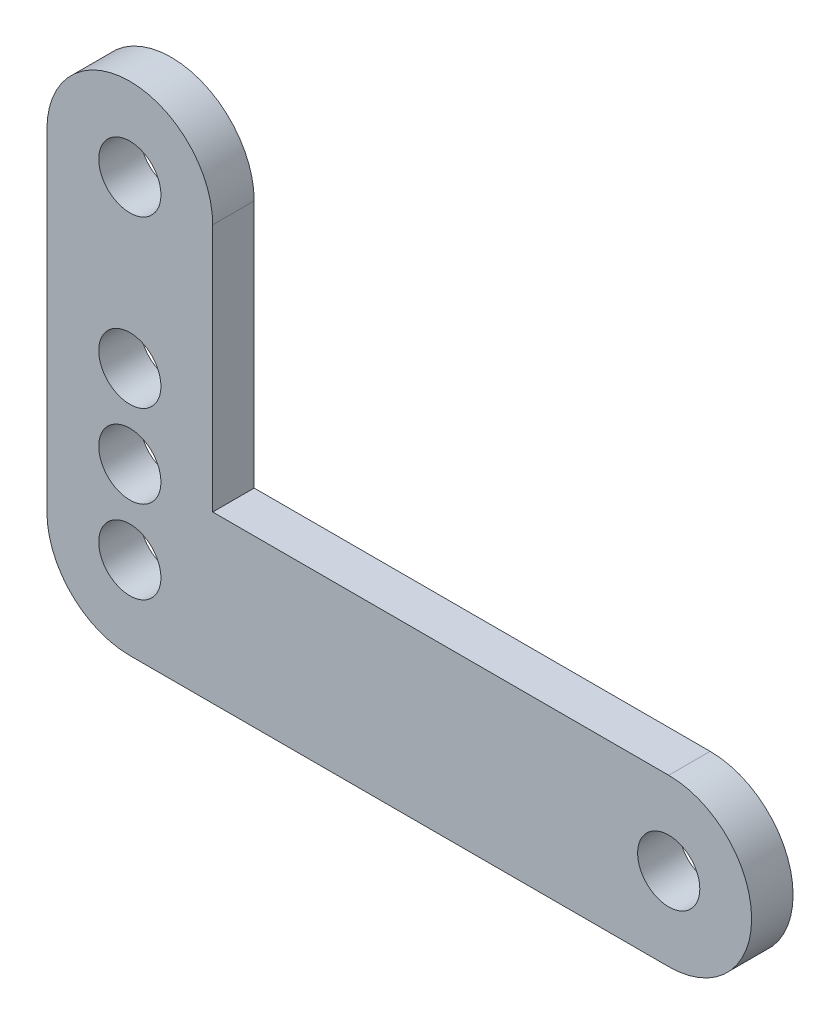
ISO-10303-21;
HEADER;
FILE_DESCRIPTION(('STEP AP214'),'2;1');
FILE_NAME('part.step','',(''),(''),'','','');
FILE_SCHEMA(('AUTOMOTIVE_DESIGN { 1 0 10303 214 1 1 1 1 }'));
ENDSEC;
DATA;
#1=APPLICATION_CONTEXT('core data for automotive mechanical design processes');
#2=APPLICATION_PROTOCOL_DEFINITION('international standard','automotive_design',2000,#1);
#3=PRODUCT_CONTEXT('',#1,'mechanical');
#4=PRODUCT('Part','Part','',(#3));
#5=PRODUCT_RELATED_PRODUCT_CATEGORY('part','',(#4));
#6=PRODUCT_DEFINITION_FORMATION('','',#4);
#7=PRODUCT_DEFINITION_CONTEXT('part definition',#1,'design');
#8=PRODUCT_DEFINITION('design','',#6,#7);
#9=PRODUCT_DEFINITION_SHAPE('','',#8);
#10=(LENGTH_UNIT() NAMED_UNIT(*) SI_UNIT(.MILLI.,.METRE.));
#11=(NAMED_UNIT(*) PLANE_ANGLE_UNIT() SI_UNIT($,.RADIAN.));
#12=(NAMED_UNIT(*) SI_UNIT($,.STERADIAN.) SOLID_ANGLE_UNIT());
#13=UNCERTAINTY_MEASURE_WITH_UNIT(LENGTH_MEASURE(1.E-05),#10,'distance_accuracy_value','');
#14=(GEOMETRIC_REPRESENTATION_CONTEXT(3) GLOBAL_UNCERTAINTY_ASSIGNED_CONTEXT((#13)) GLOBAL_UNIT_ASSIGNED_CONTEXT((#10,
#11,#12)) REPRESENTATION_CONTEXT('',''));
#15=CARTESIAN_POINT('',(0.,0.,0.));
#16=DIRECTION('',(0.,0.,1.));
#17=DIRECTION('',(1.,0.,0.));
#18=AXIS2_PLACEMENT_3D('',#15,#16,#17);
#19=CARTESIAN_POINT('',(-82.55,0.,6.35));
#20=DIRECTION('',(0.,0.,-1.));
#21=DIRECTION('',(-1.,0.,0.));
#22=AXIS2_PLACEMENT_3D('',#19,#20,#21);
#23=CYLINDRICAL_SURFACE('',#22,12.7);
#24=CARTESIAN_POINT('',(-82.55,0.,0.));
#25=DIRECTION('',(0.,0.,1.));
#26=DIRECTION('',(1.,0.,0.));
#27=AXIS2_PLACEMENT_3D('',#24,#25,#26);
#28=CIRCLE('',#27,12.7);
#29=CARTESIAN_POINT('',(-95.25,0.,0.));
#30=VERTEX_POINT('',#29);
#31=CARTESIAN_POINT('',(-82.55,-12.7,0.));
#32=VERTEX_POINT('',#31);
#33=EDGE_CURVE('E143',#30,#32,#28,.T.);
#34=ORIENTED_EDGE('',*,*,#33,.T.);
#35=DIRECTION('',(0.,0.,-1.));
#36=VECTOR('',#35,1.);
#37=CARTESIAN_POINT('',(-82.55,-12.7,6.35));
#38=LINE('',#37,#36);
#39=CARTESIAN_POINT('',(-82.55,-12.7,6.35));
#40=VERTEX_POINT('',#39);
#41=EDGE_CURVE('E11',#40,#32,#38,.T.);
#42=ORIENTED_EDGE('',*,*,#41,.F.);
#43=CARTESIAN_POINT('',(-82.55,0.,6.35));
#44=DIRECTION('',(0.,0.,1.));
#45=DIRECTION('',(1.,0.,0.));
#46=AXIS2_PLACEMENT_3D('',#43,#44,#45);
#47=CIRCLE('',#46,12.7);
#48=CARTESIAN_POINT('',(-95.25,0.,6.35));
#49=VERTEX_POINT('',#48);
#50=EDGE_CURVE('E89',#49,#40,#47,.T.);
#51=ORIENTED_EDGE('',*,*,#50,.F.);
#52=DIRECTION('',(0.,0.,-1.));
#53=VECTOR('',#52,1.);
#54=CARTESIAN_POINT('',(-95.25,0.,6.35));
#55=LINE('',#54,#53);
#56=EDGE_CURVE('E54',#49,#30,#55,.T.);
#57=ORIENTED_EDGE('',*,*,#56,.T.);
#58=EDGE_LOOP('',(#34,#42,#51,#57));
#59=FACE_BOUND('',#58,.T.);
#60=ADVANCED_FACE('F37',(#59),#23,.T.);
#61=CARTESIAN_POINT('',(0.,-12.7,6.35));
#62=DIRECTION('',(0.,-1.,0.));
#63=DIRECTION('',(1.,0.,0.));
#64=AXIS2_PLACEMENT_3D('',#61,#62,#63);
#65=PLANE('',#64);
#66=DIRECTION('',(-1.,0.,0.));
#67=VECTOR('',#66,1.);
#68=CARTESIAN_POINT('',(0.,-12.7,0.));
#69=LINE('',#68,#67);
#70=CARTESIAN_POINT('',(0.,-12.7,0.));
#71=VERTEX_POINT('',#70);
#72=EDGE_CURVE('E145',#71,#32,#69,.T.);
#73=ORIENTED_EDGE('',*,*,#72,.F.);
#74=DIRECTION('',(0.,0.,-1.));
#75=VECTOR('',#74,1.);
#76=CARTESIAN_POINT('',(0.,-12.7,6.35));
#77=LINE('',#76,#75);
#78=CARTESIAN_POINT('',(0.,-12.7,6.35));
#79=VERTEX_POINT('',#78);
#80=EDGE_CURVE('E46',#79,#71,#77,.T.);
#81=ORIENTED_EDGE('',*,*,#80,.F.);
#82=DIRECTION('',(-1.,0.,0.));
#83=VECTOR('',#82,1.);
#84=CARTESIAN_POINT('',(0.,-12.7,6.35));
#85=LINE('',#84,#83);
#86=EDGE_CURVE('E187',#79,#40,#85,.T.);
#87=ORIENTED_EDGE('',*,*,#86,.T.);
#88=ORIENTED_EDGE('',*,*,#41,.T.);
#89=EDGE_LOOP('',(#73,#81,#87,#88));
#90=FACE_BOUND('',#89,.T.);
#91=ADVANCED_FACE('F186',(#90),#65,.T.);
#92=CARTESIAN_POINT('',(0.,0.,6.35));
#93=DIRECTION('',(0.,0.,-1.));
#94=DIRECTION('',(-1.,0.,0.));
#95=AXIS2_PLACEMENT_3D('',#92,#93,#94);
#96=CYLINDRICAL_SURFACE('',#95,12.7);
#97=CARTESIAN_POINT('',(0.,0.,0.));
#98=DIRECTION('',(0.,0.,1.));
#99=DIRECTION('',(1.,0.,0.));
#100=AXIS2_PLACEMENT_3D('',#97,#98,#99);
#101=CIRCLE('',#100,12.7);
#102=CARTESIAN_POINT('',(0.,12.7,0.));
#103=VERTEX_POINT('',#102);
#104=EDGE_CURVE('E148',#71,#103,#101,.T.);
#105=ORIENTED_EDGE('',*,*,#104,.T.);
#106=DIRECTION('',(0.,0.,-1.));
#107=VECTOR('',#106,1.);
#108=CARTESIAN_POINT('',(0.,12.7,6.35));
#109=LINE('',#108,#107);
#110=CARTESIAN_POINT('',(0.,12.7,6.35));
#111=VERTEX_POINT('',#110);
#112=EDGE_CURVE('E171',#111,#103,#109,.T.);
#113=ORIENTED_EDGE('',*,*,#112,.F.);
#114=CARTESIAN_POINT('',(0.,0.,6.35));
#115=DIRECTION('',(0.,0.,1.));
#116=DIRECTION('',(1.,0.,0.));
#117=AXIS2_PLACEMENT_3D('',#114,#115,#116);
#118=CIRCLE('',#117,12.7);
#119=EDGE_CURVE('E178',#79,#111,#118,.T.);
#120=ORIENTED_EDGE('',*,*,#119,.F.);
#121=ORIENTED_EDGE('',*,*,#80,.T.);
#122=EDGE_LOOP('',(#105,#113,#120,#121));
#123=FACE_BOUND('',#122,.T.);
#124=ADVANCED_FACE('F176',(#123),#96,.T.);
#125=CARTESIAN_POINT('',(0.,12.7,6.35));
#126=DIRECTION('',(0.,-1.,0.));
#127=DIRECTION('',(1.,0.,0.));
#128=AXIS2_PLACEMENT_3D('',#125,#126,#127);
#129=PLANE('',#128);
#130=DIRECTION('',(-1.,0.,0.));
#131=VECTOR('',#130,1.);
#132=CARTESIAN_POINT('',(0.,12.7,0.));
#133=LINE('',#132,#131);
#134=CARTESIAN_POINT('',(-69.85,12.7,0.));
#135=VERTEX_POINT('',#134);
#136=EDGE_CURVE('E150',#103,#135,#133,.T.);
#137=ORIENTED_EDGE('',*,*,#136,.T.);
#138=DIRECTION('',(0.,0.,-1.));
#139=VECTOR('',#138,1.);
#140=CARTESIAN_POINT('',(-69.85,12.7,6.35));
#141=LINE('',#140,#139);
#142=CARTESIAN_POINT('',(-69.85,12.7,6.35));
#143=VERTEX_POINT('',#142);
#144=EDGE_CURVE('E120',#143,#135,#141,.T.);
#145=ORIENTED_EDGE('',*,*,#144,.F.);
#146=DIRECTION('',(-1.,0.,0.));
#147=VECTOR('',#146,1.);
#148=CARTESIAN_POINT('',(0.,12.7,6.35));
#149=LINE('',#148,#147);
#150=EDGE_CURVE('E108',#111,#143,#149,.T.);
#151=ORIENTED_EDGE('',*,*,#150,.F.);
#152=ORIENTED_EDGE('',*,*,#112,.T.);
#153=EDGE_LOOP('',(#137,#145,#151,#152));
#154=FACE_BOUND('',#153,.T.);
#155=ADVANCED_FACE('F211',(#154),#129,.F.);
#156=CARTESIAN_POINT('',(-69.85,0.,6.35));
#157=DIRECTION('',(-1.,0.,0.));
#158=DIRECTION('',(0.,0.,1.));
#159=AXIS2_PLACEMENT_3D('',#156,#157,#158);
#160=PLANE('',#159);
#161=DIRECTION('',(0.,1.,0.));
#162=VECTOR('',#161,1.);
#163=CARTESIAN_POINT('',(-69.85,0.,0.));
#164=LINE('',#163,#162);
#165=CARTESIAN_POINT('',(-69.85,50.8,0.));
#166=VERTEX_POINT('',#165);
#167=EDGE_CURVE('E117',#135,#166,#164,.T.);
#168=ORIENTED_EDGE('',*,*,#167,.T.);
#169=DIRECTION('',(0.,0.,-1.));
#170=VECTOR('',#169,1.);
#171=CARTESIAN_POINT('',(-69.85,50.8,6.35));
#172=LINE('',#171,#170);
#173=CARTESIAN_POINT('',(-69.85,50.8,6.35));
#174=VERTEX_POINT('',#173);
#175=EDGE_CURVE('E114',#174,#166,#172,.T.);
#176=ORIENTED_EDGE('',*,*,#175,.F.);
#177=DIRECTION('',(0.,1.,0.));
#178=VECTOR('',#177,1.);
#179=CARTESIAN_POINT('',(-69.85,0.,6.35));
#180=LINE('',#179,#178);
#181=EDGE_CURVE('E101',#143,#174,#180,.T.);
#182=ORIENTED_EDGE('',*,*,#181,.F.);
#183=ORIENTED_EDGE('',*,*,#144,.T.);
#184=EDGE_LOOP('',(#168,#176,#182,#183));
#185=FACE_BOUND('',#184,.T.);
#186=ADVANCED_FACE('F115',(#185),#160,.F.);
#187=CARTESIAN_POINT('',(-82.55,50.8,6.35));
#188=DIRECTION('',(0.,0.,-1.));
#189=DIRECTION('',(-1.,0.,0.));
#190=AXIS2_PLACEMENT_3D('',#187,#188,#189);
#191=CYLINDRICAL_SURFACE('',#190,12.7);
#192=CARTESIAN_POINT('',(-82.55,50.8,0.));
#193=DIRECTION('',(0.,0.,1.));
#194=DIRECTION('',(1.,0.,0.));
#195=AXIS2_PLACEMENT_3D('',#192,#193,#194);
#196=CIRCLE('',#195,12.7);
#197=CARTESIAN_POINT('',(-95.2500000000001,50.8,0.));
#198=VERTEX_POINT('',#197);
#199=EDGE_CURVE('E153',#166,#198,#196,.T.);
#200=ORIENTED_EDGE('',*,*,#199,.T.);
#201=DIRECTION('',(0.,0.,-1.));
#202=VECTOR('',#201,1.);
#203=CARTESIAN_POINT('',(-95.2500000000001,50.8,6.35));
#204=LINE('',#203,#202);
#205=CARTESIAN_POINT('',(-95.2500000000001,50.8,6.35));
#206=VERTEX_POINT('',#205);
#207=EDGE_CURVE('E77',#206,#198,#204,.T.);
#208=ORIENTED_EDGE('',*,*,#207,.F.);
#209=CARTESIAN_POINT('',(-82.55,50.8,6.35));
#210=DIRECTION('',(0.,0.,1.));
#211=DIRECTION('',(1.,0.,0.));
#212=AXIS2_PLACEMENT_3D('',#209,#210,#211);
#213=CIRCLE('',#212,12.7);
#214=EDGE_CURVE('E106',#174,#206,#213,.T.);
#215=ORIENTED_EDGE('',*,*,#214,.F.);
#216=ORIENTED_EDGE('',*,*,#175,.T.);
#217=EDGE_LOOP('',(#200,#208,#215,#216));
#218=FACE_BOUND('',#217,.T.);
#219=ADVANCED_FACE('F122',(#218),#191,.T.);
#220=CARTESIAN_POINT('',(-82.55,0.,6.35));
#221=DIRECTION('',(0.,0.,-1.));
#222=DIRECTION('',(-1.,0.,0.));
#223=AXIS2_PLACEMENT_3D('',#220,#221,#222);
#224=CYLINDRICAL_SURFACE('',#223,4.76250000000001);
#225=CARTESIAN_POINT('',(-82.55,0.,6.35));
#226=DIRECTION('',(0.,0.,1.));
#227=DIRECTION('',(1.,0.,0.));
#228=AXIS2_PLACEMENT_3D('',#225,#226,#227);
#229=CIRCLE('',#228,4.76250000000001);
#230=CARTESIAN_POINT('',(-77.7875,0.,6.35));
#231=VERTEX_POINT('',#230);
#232=EDGE_CURVE('E131',#231,#231,#229,.T.);
#233=ORIENTED_EDGE('',*,*,#232,.T.);
#234=EDGE_LOOP('',(#233));
#235=FACE_BOUND('',#234,.T.);
#236=CARTESIAN_POINT('',(-82.55,0.,0.));
#237=DIRECTION('',(0.,0.,1.));
#238=DIRECTION('',(1.,0.,0.));
#239=AXIS2_PLACEMENT_3D('',#236,#237,#238);
#240=CIRCLE('',#239,4.76250000000001);
#241=CARTESIAN_POINT('',(-77.7875,0.,0.));
#242=VERTEX_POINT('',#241);
#243=EDGE_CURVE('E161',#242,#242,#240,.T.);
#244=ORIENTED_EDGE('',*,*,#243,.F.);
#245=EDGE_LOOP('',(#244));
#246=FACE_BOUND('',#245,.T.);
#247=ADVANCED_FACE('F198',(#235,#246),#224,.F.);
#248=CARTESIAN_POINT('',(-82.55,50.8,6.35));
#249=DIRECTION('',(0.,0.,-1.));
#250=DIRECTION('',(-1.,0.,0.));
#251=AXIS2_PLACEMENT_3D('',#248,#249,#250);
#252=CYLINDRICAL_SURFACE('',#251,4.76250000000001);
#253=CARTESIAN_POINT('',(-82.55,50.8,6.35));
#254=DIRECTION('',(0.,0.,1.));
#255=DIRECTION('',(1.,0.,0.));
#256=AXIS2_PLACEMENT_3D('',#253,#254,#255);
#257=CIRCLE('',#256,4.76250000000001);
#258=CARTESIAN_POINT('',(-77.7875,50.8,6.35));
#259=VERTEX_POINT('',#258);
#260=EDGE_CURVE('E125',#259,#259,#257,.T.);
#261=ORIENTED_EDGE('',*,*,#260,.T.);
#262=EDGE_LOOP('',(#261));
#263=FACE_BOUND('',#262,.T.);
#264=CARTESIAN_POINT('',(-82.55,50.8,0.));
#265=DIRECTION('',(0.,0.,1.));
#266=DIRECTION('',(1.,0.,0.));
#267=AXIS2_PLACEMENT_3D('',#264,#265,#266);
#268=CIRCLE('',#267,4.76250000000001);
#269=CARTESIAN_POINT('',(-77.7875,50.8,0.));
#270=VERTEX_POINT('',#269);
#271=EDGE_CURVE('E158',#270,#270,#268,.T.);
#272=ORIENTED_EDGE('',*,*,#271,.F.);
#273=EDGE_LOOP('',(#272));
#274=FACE_BOUND('',#273,.T.);
#275=ADVANCED_FACE('F191',(#263,#274),#252,.F.);
#276=CARTESIAN_POINT('',(-95.2500000000001,0.,6.35));
#277=DIRECTION('',(-1.,0.,0.));
#278=DIRECTION('',(0.,0.,1.));
#279=AXIS2_PLACEMENT_3D('',#276,#277,#278);
#280=PLANE('',#279);
#281=DIRECTION('',(0.,1.,0.));
#282=VECTOR('',#281,1.);
#283=CARTESIAN_POINT('',(-95.2500000000001,0.,0.));
#284=LINE('',#283,#282);
#285=EDGE_CURVE('E155',#30,#198,#284,.T.);
#286=ORIENTED_EDGE('',*,*,#285,.F.);
#287=ORIENTED_EDGE('',*,*,#56,.F.);
#288=DIRECTION('',(0.,1.,0.));
#289=VECTOR('',#288,1.);
#290=CARTESIAN_POINT('',(-95.2500000000001,0.,6.35));
#291=LINE('',#290,#289);
#292=EDGE_CURVE('E123',#49,#206,#291,.T.);
#293=ORIENTED_EDGE('',*,*,#292,.T.);
#294=ORIENTED_EDGE('',*,*,#207,.T.);
#295=EDGE_LOOP('',(#286,#287,#293,#294));
#296=FACE_BOUND('',#295,.T.);
#297=ADVANCED_FACE('F188',(#296),#280,.T.);
#298=CARTESIAN_POINT('',(-82.55,25.4,6.35));
#299=DIRECTION('',(0.,0.,-1.));
#300=DIRECTION('',(-1.,0.,0.));
#301=AXIS2_PLACEMENT_3D('',#298,#299,#300);
#302=CYLINDRICAL_SURFACE('',#301,4.7625);
#303=CARTESIAN_POINT('',(-82.55,25.4,6.35));
#304=DIRECTION('',(0.,0.,1.));
#305=DIRECTION('',(1.,0.,0.));
#306=AXIS2_PLACEMENT_3D('',#303,#304,#305);
#307=CIRCLE('',#306,4.7625);
#308=CARTESIAN_POINT('',(-77.7875,25.4,6.35));
#309=VERTEX_POINT('',#308);
#310=EDGE_CURVE('E242',#309,#309,#307,.T.);
#311=ORIENTED_EDGE('',*,*,#310,.T.);
#312=EDGE_LOOP('',(#311));
#313=FACE_BOUND('',#312,.T.);
#314=CARTESIAN_POINT('',(-82.55,25.4,0.));
#315=DIRECTION('',(0.,0.,1.));
#316=DIRECTION('',(1.,0.,0.));
#317=AXIS2_PLACEMENT_3D('',#314,#315,#316);
#318=CIRCLE('',#317,4.7625);
#319=CARTESIAN_POINT('',(-77.7875,25.4,0.));
#320=VERTEX_POINT('',#319);
#321=EDGE_CURVE('E140',#320,#320,#318,.T.);
#322=ORIENTED_EDGE('',*,*,#321,.F.);
#323=EDGE_LOOP('',(#322));
#324=FACE_BOUND('',#323,.T.);
#325=ADVANCED_FACE('F190',(#313,#324),#302,.F.);
#326=CARTESIAN_POINT('',(-82.55,12.7,6.35));
#327=DIRECTION('',(0.,0.,-1.));
#328=DIRECTION('',(-1.,0.,0.));
#329=AXIS2_PLACEMENT_3D('',#326,#327,#328);
#330=CYLINDRICAL_SURFACE('',#329,4.7625);
#331=CARTESIAN_POINT('',(-82.55,12.7,6.35));
#332=DIRECTION('',(0.,0.,1.));
#333=DIRECTION('',(1.,0.,0.));
#334=AXIS2_PLACEMENT_3D('',#331,#332,#333);
#335=CIRCLE('',#334,4.7625);
#336=CARTESIAN_POINT('',(-77.7875,12.7,6.35));
#337=VERTEX_POINT('',#336);
#338=EDGE_CURVE('E167',#337,#337,#335,.T.);
#339=ORIENTED_EDGE('',*,*,#338,.T.);
#340=EDGE_LOOP('',(#339));
#341=FACE_BOUND('',#340,.T.);
#342=CARTESIAN_POINT('',(-82.55,12.7,0.));
#343=DIRECTION('',(0.,0.,1.));
#344=DIRECTION('',(1.,0.,0.));
#345=AXIS2_PLACEMENT_3D('',#342,#343,#344);
#346=CIRCLE('',#345,4.7625);
#347=CARTESIAN_POINT('',(-77.7875,12.7,0.));
#348=VERTEX_POINT('',#347);
#349=EDGE_CURVE('E137',#348,#348,#346,.T.);
#350=ORIENTED_EDGE('',*,*,#349,.F.);
#351=EDGE_LOOP('',(#350));
#352=FACE_BOUND('',#351,.T.);
#353=ADVANCED_FACE('F39',(#341,#352),#330,.F.);
#354=CARTESIAN_POINT('',(0.,0.,6.35));
#355=DIRECTION('',(0.,0.,-1.));
#356=DIRECTION('',(-1.,0.,0.));
#357=AXIS2_PLACEMENT_3D('',#354,#355,#356);
#358=CYLINDRICAL_SURFACE('',#357,4.7625);
#359=CARTESIAN_POINT('',(0.,0.,6.35));
#360=DIRECTION('',(0.,0.,1.));
#361=DIRECTION('',(1.,0.,0.));
#362=AXIS2_PLACEMENT_3D('',#359,#360,#361);
#363=CIRCLE('',#362,4.7625);
#364=CARTESIAN_POINT('',(4.7625,0.,6.35));
#365=VERTEX_POINT('',#364);
#366=EDGE_CURVE('E134',#365,#365,#363,.T.);
#367=ORIENTED_EDGE('',*,*,#366,.T.);
#368=EDGE_LOOP('',(#367));
#369=FACE_BOUND('',#368,.T.);
#370=CARTESIAN_POINT('',(0.,0.,0.));
#371=DIRECTION('',(0.,0.,1.));
#372=DIRECTION('',(1.,0.,0.));
#373=AXIS2_PLACEMENT_3D('',#370,#371,#372);
#374=CIRCLE('',#373,4.7625);
#375=CARTESIAN_POINT('',(4.7625,0.,0.));
#376=VERTEX_POINT('',#375);
#377=EDGE_CURVE('E164',#376,#376,#374,.T.);
#378=ORIENTED_EDGE('',*,*,#377,.F.);
#379=EDGE_LOOP('',(#378));
#380=FACE_BOUND('',#379,.T.);
#381=ADVANCED_FACE('F226',(#369,#380),#358,.F.);
#382=CARTESIAN_POINT('',(0.,0.,6.35));
#383=DIRECTION('',(0.,0.,1.));
#384=DIRECTION('',(1.,0.,0.));
#385=AXIS2_PLACEMENT_3D('',#382,#383,#384);
#386=PLANE('',#385);
#387=ORIENTED_EDGE('',*,*,#338,.F.);
#388=EDGE_LOOP('',(#387));
#389=FACE_BOUND('',#388,.T.);
#390=ORIENTED_EDGE('',*,*,#310,.F.);
#391=EDGE_LOOP('',(#390));
#392=FACE_BOUND('',#391,.T.);
#393=ORIENTED_EDGE('',*,*,#50,.T.);
#394=ORIENTED_EDGE('',*,*,#86,.F.);
#395=ORIENTED_EDGE('',*,*,#119,.T.);
#396=ORIENTED_EDGE('',*,*,#150,.T.);
#397=ORIENTED_EDGE('',*,*,#181,.T.);
#398=ORIENTED_EDGE('',*,*,#214,.T.);
#399=ORIENTED_EDGE('',*,*,#292,.F.);
#400=EDGE_LOOP('',(#393,#394,#395,#396,#397,#398,#399));
#401=FACE_BOUND('',#400,.T.);
#402=ORIENTED_EDGE('',*,*,#260,.F.);
#403=EDGE_LOOP('',(#402));
#404=FACE_BOUND('',#403,.T.);
#405=ORIENTED_EDGE('',*,*,#232,.F.);
#406=EDGE_LOOP('',(#405));
#407=FACE_BOUND('',#406,.T.);
#408=ORIENTED_EDGE('',*,*,#366,.F.);
#409=EDGE_LOOP('',(#408));
#410=FACE_BOUND('',#409,.T.);
#411=ADVANCED_FACE('F103',(#389,#392,#401,#404,#407,#410),#386,.T.);
#412=CARTESIAN_POINT('',(0.,0.,0.));
#413=DIRECTION('',(0.,0.,1.));
#414=DIRECTION('',(1.,0.,0.));
#415=AXIS2_PLACEMENT_3D('',#412,#413,#414);
#416=PLANE('',#415);
#417=ORIENTED_EDGE('',*,*,#349,.T.);
#418=EDGE_LOOP('',(#417));
#419=FACE_BOUND('',#418,.T.);
#420=ORIENTED_EDGE('',*,*,#321,.T.);
#421=EDGE_LOOP('',(#420));
#422=FACE_BOUND('',#421,.T.);
#423=ORIENTED_EDGE('',*,*,#33,.F.);
#424=ORIENTED_EDGE('',*,*,#285,.T.);
#425=ORIENTED_EDGE('',*,*,#199,.F.);
#426=ORIENTED_EDGE('',*,*,#167,.F.);
#427=ORIENTED_EDGE('',*,*,#136,.F.);
#428=ORIENTED_EDGE('',*,*,#104,.F.);
#429=ORIENTED_EDGE('',*,*,#72,.T.);
#430=EDGE_LOOP('',(#423,#424,#425,#426,#427,#428,#429));
#431=FACE_BOUND('',#430,.T.);
#432=ORIENTED_EDGE('',*,*,#271,.T.);
#433=EDGE_LOOP('',(#432));
#434=FACE_BOUND('',#433,.T.);
#435=ORIENTED_EDGE('',*,*,#243,.T.);
#436=EDGE_LOOP('',(#435));
#437=FACE_BOUND('',#436,.T.);
#438=ORIENTED_EDGE('',*,*,#377,.T.);
#439=EDGE_LOOP('',(#438));
#440=FACE_BOUND('',#439,.T.);
#441=ADVANCED_FACE('F184',(#419,#422,#431,#434,#437,#440),#416,.F.);
#442=CLOSED_SHELL('',(#60,#91,#124,#155,#186,#219,#247,#275,#297,#325,#353,#381,#411,#441));
#443=MANIFOLD_SOLID_BREP('B2',#442);
#444=ADVANCED_BREP_SHAPE_REPRESENTATION('',(#18,#443),#14);
#445=SHAPE_DEFINITION_REPRESENTATION(#9,#444);
ENDSEC;
END-ISO-10303-21;
